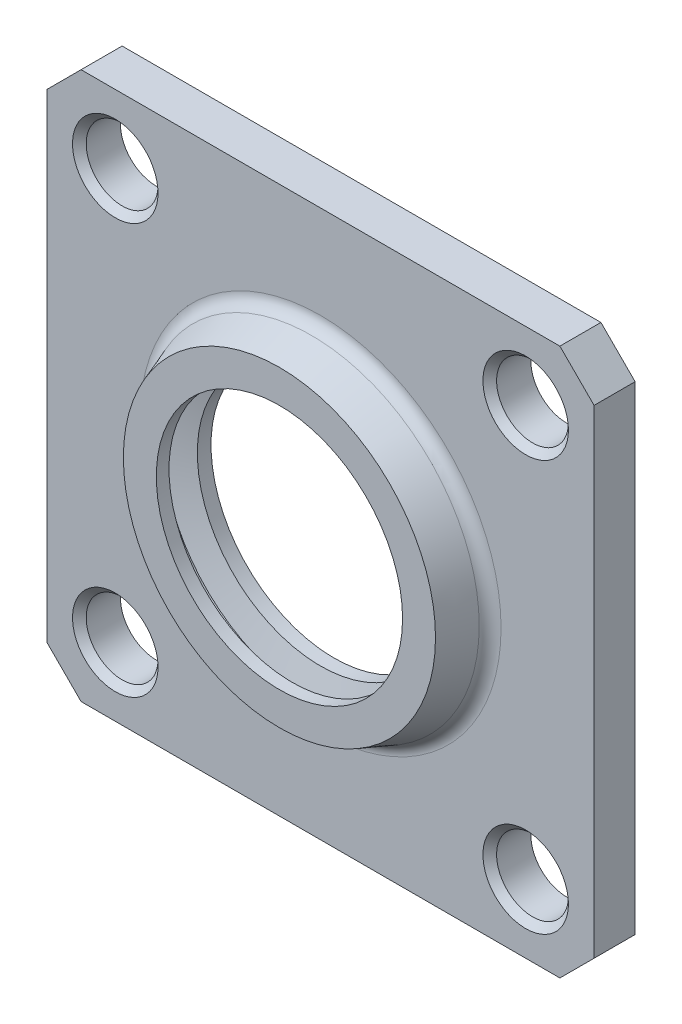
ISO-10303-21;
HEADER;
FILE_DESCRIPTION(('STEP AP214'),'2;1');
FILE_NAME('part.step','',(''),(''),'','','');
FILE_SCHEMA(('AUTOMOTIVE_DESIGN { 1 0 10303 214 1 1 1 1 }'));
ENDSEC;
DATA;
#1=APPLICATION_CONTEXT('core data for automotive mechanical design processes');
#2=APPLICATION_PROTOCOL_DEFINITION('international standard','automotive_design',2000,#1);
#3=PRODUCT_CONTEXT('',#1,'mechanical');
#4=PRODUCT('Part','Part','',(#3));
#5=PRODUCT_RELATED_PRODUCT_CATEGORY('part','',(#4));
#6=PRODUCT_DEFINITION_FORMATION('','',#4);
#7=PRODUCT_DEFINITION_CONTEXT('part definition',#1,'design');
#8=PRODUCT_DEFINITION('design','',#6,#7);
#9=PRODUCT_DEFINITION_SHAPE('','',#8);
#10=(LENGTH_UNIT() NAMED_UNIT(*) SI_UNIT(.MILLI.,.METRE.));
#11=(NAMED_UNIT(*) PLANE_ANGLE_UNIT() SI_UNIT($,.RADIAN.));
#12=(NAMED_UNIT(*) SI_UNIT($,.STERADIAN.) SOLID_ANGLE_UNIT());
#13=UNCERTAINTY_MEASURE_WITH_UNIT(LENGTH_MEASURE(1.E-05),#10,'distance_accuracy_value','');
#14=(GEOMETRIC_REPRESENTATION_CONTEXT(3) GLOBAL_UNCERTAINTY_ASSIGNED_CONTEXT((#13)) GLOBAL_UNIT_ASSIGNED_CONTEXT((#10,
#11,#12)) REPRESENTATION_CONTEXT('',''));
#15=CARTESIAN_POINT('',(0.,0.,0.));
#16=DIRECTION('',(0.,0.,1.));
#17=DIRECTION('',(1.,0.,0.));
#18=AXIS2_PLACEMENT_3D('',#15,#16,#17);
#19=CARTESIAN_POINT('',(-30.,-30.,0.959883800153095));
#20=DIRECTION('',(0.,-1.,0.));
#21=DIRECTION('',(0.,0.,-1.));
#22=AXIS2_PLACEMENT_3D('',#19,#20,#21);
#23=PLANE('',#22);
#24=DIRECTION('',(1.,0.,0.));
#25=VECTOR('',#24,1.);
#26=CARTESIAN_POINT('',(-30.,-30.,0.959883800153095));
#27=LINE('',#26,#25);
#28=CARTESIAN_POINT('',(-26.25,-30.,0.959883800153095));
#29=VERTEX_POINT('',#28);
#30=CARTESIAN_POINT('',(26.25,-30.,0.959883800153095));
#31=VERTEX_POINT('',#30);
#32=EDGE_CURVE('E301',#29,#31,#27,.T.);
#33=ORIENTED_EDGE('',*,*,#32,.T.);
#34=DIRECTION('',(0.,0.,1.));
#35=VECTOR('',#34,1.);
#36=CARTESIAN_POINT('',(26.25,-30.,0.959883800153095));
#37=LINE('',#36,#35);
#38=CARTESIAN_POINT('',(26.25,-30.,5.4598838001531));
#39=VERTEX_POINT('',#38);
#40=EDGE_CURVE('E121',#31,#39,#37,.T.);
#41=ORIENTED_EDGE('',*,*,#40,.T.);
#42=DIRECTION('',(1.,0.,0.));
#43=VECTOR('',#42,1.);
#44=CARTESIAN_POINT('',(-30.,-30.,5.4598838001531));
#45=LINE('',#44,#43);
#46=CARTESIAN_POINT('',(-26.25,-30.,5.4598838001531));
#47=VERTEX_POINT('',#46);
#48=EDGE_CURVE('E105',#47,#39,#45,.T.);
#49=ORIENTED_EDGE('',*,*,#48,.F.);
#50=DIRECTION('',(0.,0.,-1.));
#51=VECTOR('',#50,1.);
#52=CARTESIAN_POINT('',(-26.25,-30.,0.959883800153095));
#53=LINE('',#52,#51);
#54=EDGE_CURVE('E118',#47,#29,#53,.T.);
#55=ORIENTED_EDGE('',*,*,#54,.T.);
#56=EDGE_LOOP('',(#33,#41,#49,#55));
#57=FACE_BOUND('',#56,.T.);
#58=ADVANCED_FACE('F35',(#57),#23,.T.);
#59=CARTESIAN_POINT('',(-30.,30.,0.959883800153095));
#60=DIRECTION('',(-1.,0.,0.));
#61=DIRECTION('',(0.,0.,1.));
#62=AXIS2_PLACEMENT_3D('',#59,#60,#61);
#63=PLANE('',#62);
#64=DIRECTION('',(0.,-1.,0.));
#65=VECTOR('',#64,1.);
#66=CARTESIAN_POINT('',(-30.,30.,0.959883800153095));
#67=LINE('',#66,#65);
#68=CARTESIAN_POINT('',(-30.,26.25,0.959883800153095));
#69=VERTEX_POINT('',#68);
#70=CARTESIAN_POINT('',(-30.,-26.25,0.959883800153095));
#71=VERTEX_POINT('',#70);
#72=EDGE_CURVE('E128',#69,#71,#67,.T.);
#73=ORIENTED_EDGE('',*,*,#72,.T.);
#74=DIRECTION('',(0.,0.,1.));
#75=VECTOR('',#74,1.);
#76=CARTESIAN_POINT('',(-30.,-26.25,0.959883800153095));
#77=LINE('',#76,#75);
#78=CARTESIAN_POINT('',(-30.,-26.25,5.4598838001531));
#79=VERTEX_POINT('',#78);
#80=EDGE_CURVE('E154',#71,#79,#77,.T.);
#81=ORIENTED_EDGE('',*,*,#80,.T.);
#82=DIRECTION('',(0.,-1.,0.));
#83=VECTOR('',#82,1.);
#84=CARTESIAN_POINT('',(-30.,30.,5.4598838001531));
#85=LINE('',#84,#83);
#86=CARTESIAN_POINT('',(-30.,26.25,5.4598838001531));
#87=VERTEX_POINT('',#86);
#88=EDGE_CURVE('E107',#87,#79,#85,.T.);
#89=ORIENTED_EDGE('',*,*,#88,.F.);
#90=DIRECTION('',(0.,0.,-1.));
#91=VECTOR('',#90,1.);
#92=CARTESIAN_POINT('',(-30.,26.25,0.959883800153095));
#93=LINE('',#92,#91);
#94=EDGE_CURVE('E152',#87,#69,#93,.T.);
#95=ORIENTED_EDGE('',*,*,#94,.T.);
#96=EDGE_LOOP('',(#73,#81,#89,#95));
#97=FACE_BOUND('',#96,.T.);
#98=ADVANCED_FACE('F211',(#97),#63,.T.);
#99=CARTESIAN_POINT('',(30.,30.,0.959883800153095));
#100=DIRECTION('',(0.,1.,0.));
#101=DIRECTION('',(0.,0.,1.));
#102=AXIS2_PLACEMENT_3D('',#99,#100,#101);
#103=PLANE('',#102);
#104=DIRECTION('',(-1.,0.,0.));
#105=VECTOR('',#104,1.);
#106=CARTESIAN_POINT('',(30.,30.,5.4598838001531));
#107=LINE('',#106,#105);
#108=CARTESIAN_POINT('',(26.25,30.,5.4598838001531));
#109=VERTEX_POINT('',#108);
#110=CARTESIAN_POINT('',(-26.25,30.,5.4598838001531));
#111=VERTEX_POINT('',#110);
#112=EDGE_CURVE('E308',#109,#111,#107,.T.);
#113=ORIENTED_EDGE('',*,*,#112,.F.);
#114=DIRECTION('',(0.,0.,-1.));
#115=VECTOR('',#114,1.);
#116=CARTESIAN_POINT('',(26.25,30.,0.959883800153095));
#117=LINE('',#116,#115);
#118=CARTESIAN_POINT('',(26.25,30.,0.959883800153095));
#119=VERTEX_POINT('',#118);
#120=EDGE_CURVE('E57',#109,#119,#117,.T.);
#121=ORIENTED_EDGE('',*,*,#120,.T.);
#122=DIRECTION('',(-1.,0.,0.));
#123=VECTOR('',#122,1.);
#124=CARTESIAN_POINT('',(30.,30.,0.959883800153095));
#125=LINE('',#124,#123);
#126=CARTESIAN_POINT('',(-26.25,30.,0.959883800153095));
#127=VERTEX_POINT('',#126);
#128=EDGE_CURVE('E133',#119,#127,#125,.T.);
#129=ORIENTED_EDGE('',*,*,#128,.T.);
#130=DIRECTION('',(0.,0.,1.));
#131=VECTOR('',#130,1.);
#132=CARTESIAN_POINT('',(-26.25,30.,0.959883800153095));
#133=LINE('',#132,#131);
#134=EDGE_CURVE('E156',#127,#111,#133,.T.);
#135=ORIENTED_EDGE('',*,*,#134,.T.);
#136=EDGE_LOOP('',(#113,#121,#129,#135));
#137=FACE_BOUND('',#136,.T.);
#138=ADVANCED_FACE('F216',(#137),#103,.T.);
#139=CARTESIAN_POINT('',(30.,-30.,0.959883800153095));
#140=DIRECTION('',(1.,0.,0.));
#141=DIRECTION('',(0.,0.,-1.));
#142=AXIS2_PLACEMENT_3D('',#139,#140,#141);
#143=PLANE('',#142);
#144=DIRECTION('',(0.,1.,0.));
#145=VECTOR('',#144,1.);
#146=CARTESIAN_POINT('',(30.,-30.,5.4598838001531));
#147=LINE('',#146,#145);
#148=CARTESIAN_POINT('',(30.,-26.25,5.4598838001531));
#149=VERTEX_POINT('',#148);
#150=CARTESIAN_POINT('',(30.,26.25,5.4598838001531));
#151=VERTEX_POINT('',#150);
#152=EDGE_CURVE('E122',#149,#151,#147,.T.);
#153=ORIENTED_EDGE('',*,*,#152,.F.);
#154=DIRECTION('',(0.,0.,-1.));
#155=VECTOR('',#154,1.);
#156=CARTESIAN_POINT('',(30.,-26.25,0.959883800153095));
#157=LINE('',#156,#155);
#158=CARTESIAN_POINT('',(30.,-26.25,0.959883800153095));
#159=VERTEX_POINT('',#158);
#160=EDGE_CURVE('E144',#149,#159,#157,.T.);
#161=ORIENTED_EDGE('',*,*,#160,.T.);
#162=DIRECTION('',(0.,1.,0.));
#163=VECTOR('',#162,1.);
#164=CARTESIAN_POINT('',(30.,-30.,0.959883800153095));
#165=LINE('',#164,#163);
#166=CARTESIAN_POINT('',(30.,26.25,0.959883800153095));
#167=VERTEX_POINT('',#166);
#168=EDGE_CURVE('E303',#159,#167,#165,.T.);
#169=ORIENTED_EDGE('',*,*,#168,.T.);
#170=DIRECTION('',(0.,0.,1.));
#171=VECTOR('',#170,1.);
#172=CARTESIAN_POINT('',(30.,26.25,0.959883800153095));
#173=LINE('',#172,#171);
#174=EDGE_CURVE('E141',#167,#151,#173,.T.);
#175=ORIENTED_EDGE('',*,*,#174,.T.);
#176=EDGE_LOOP('',(#153,#161,#169,#175));
#177=FACE_BOUND('',#176,.T.);
#178=ADVANCED_FACE('F221',(#177),#143,.T.);
#179=CARTESIAN_POINT('',(0.,0.,0.959883800153095));
#180=DIRECTION('',(0.,0.,1.));
#181=DIRECTION('',(1.,0.,0.));
#182=AXIS2_PLACEMENT_3D('',#179,#180,#181);
#183=PLANE('',#182);
#184=CARTESIAN_POINT('',(0.,0.,0.959883800153095));
#185=DIRECTION('',(0.,0.,1.));
#186=DIRECTION('',(1.,0.,0.));
#187=AXIS2_PLACEMENT_3D('',#184,#185,#186);
#188=CIRCLE('',#187,20.2500000000295);
#189=CARTESIAN_POINT('',(20.2500000000295,0.,0.959883800153095));
#190=VERTEX_POINT('',#189);
#191=EDGE_CURVE('E178',#190,#190,#188,.T.);
#192=ORIENTED_EDGE('',*,*,#191,.T.);
#193=EDGE_LOOP('',(#192));
#194=FACE_BOUND('',#193,.T.);
#195=CARTESIAN_POINT('',(22.5,22.5,0.959883800153092));
#196=DIRECTION('',(0.,0.,1.));
#197=DIRECTION('',(1.,0.,0.));
#198=AXIS2_PLACEMENT_3D('',#195,#196,#197);
#199=CIRCLE('',#198,3.93749999999999);
#200=CARTESIAN_POINT('',(26.4375,22.5,0.959883800153092));
#201=VERTEX_POINT('',#200);
#202=EDGE_CURVE('E268',#201,#201,#199,.T.);
#203=ORIENTED_EDGE('',*,*,#202,.T.);
#204=EDGE_LOOP('',(#203));
#205=FACE_BOUND('',#204,.T.);
#206=CARTESIAN_POINT('',(-22.5,22.5,0.959883800153092));
#207=DIRECTION('',(0.,0.,1.));
#208=DIRECTION('',(1.,0.,0.));
#209=AXIS2_PLACEMENT_3D('',#206,#207,#208);
#210=CIRCLE('',#209,3.93749999999999);
#211=CARTESIAN_POINT('',(-18.5625,22.5,0.959883800153092));
#212=VERTEX_POINT('',#211);
#213=EDGE_CURVE('E270',#212,#212,#210,.T.);
#214=ORIENTED_EDGE('',*,*,#213,.T.);
#215=EDGE_LOOP('',(#214));
#216=FACE_BOUND('',#215,.T.);
#217=CARTESIAN_POINT('',(-22.5,-22.5,0.959883800153092));
#218=DIRECTION('',(0.,0.,1.));
#219=DIRECTION('',(1.,0.,0.));
#220=AXIS2_PLACEMENT_3D('',#217,#218,#219);
#221=CIRCLE('',#220,3.93749999999999);
#222=CARTESIAN_POINT('',(-18.5625,-22.5,0.959883800153092));
#223=VERTEX_POINT('',#222);
#224=EDGE_CURVE('E273',#223,#223,#221,.T.);
#225=ORIENTED_EDGE('',*,*,#224,.T.);
#226=EDGE_LOOP('',(#225));
#227=FACE_BOUND('',#226,.T.);
#228=CARTESIAN_POINT('',(22.5,-22.5,0.959883800153092));
#229=DIRECTION('',(0.,0.,1.));
#230=DIRECTION('',(1.,0.,0.));
#231=AXIS2_PLACEMENT_3D('',#228,#229,#230);
#232=CIRCLE('',#231,3.93749999999999);
#233=CARTESIAN_POINT('',(26.4375,-22.5,0.959883800153092));
#234=VERTEX_POINT('',#233);
#235=EDGE_CURVE('E278',#234,#234,#232,.T.);
#236=ORIENTED_EDGE('',*,*,#235,.T.);
#237=EDGE_LOOP('',(#236));
#238=FACE_BOUND('',#237,.T.);
#239=ORIENTED_EDGE('',*,*,#168,.F.);
#240=DIRECTION('',(0.707106781186546,0.707106781186549,0.));
#241=VECTOR('',#240,1.);
#242=CARTESIAN_POINT('',(26.25,-30.,0.959883800153095));
#243=LINE('',#242,#241);
#244=EDGE_CURVE('E150',#159,#31,#243,.F.);
#245=ORIENTED_EDGE('',*,*,#244,.T.);
#246=ORIENTED_EDGE('',*,*,#32,.F.);
#247=DIRECTION('',(0.707106781186549,-0.707106781186546,0.));
#248=VECTOR('',#247,1.);
#249=CARTESIAN_POINT('',(-30.,-26.25,0.959883800153095));
#250=LINE('',#249,#248);
#251=EDGE_CURVE('E127',#29,#71,#250,.F.);
#252=ORIENTED_EDGE('',*,*,#251,.T.);
#253=ORIENTED_EDGE('',*,*,#72,.F.);
#254=DIRECTION('',(-0.707106781186546,-0.707106781186549,0.));
#255=VECTOR('',#254,1.);
#256=CARTESIAN_POINT('',(-26.25,30.,0.959883800153095));
#257=LINE('',#256,#255);
#258=EDGE_CURVE('E50',#69,#127,#257,.F.);
#259=ORIENTED_EDGE('',*,*,#258,.T.);
#260=ORIENTED_EDGE('',*,*,#128,.F.);
#261=DIRECTION('',(-0.707106781186549,0.707106781186546,0.));
#262=VECTOR('',#261,1.);
#263=CARTESIAN_POINT('',(30.,26.25,0.959883800153095));
#264=LINE('',#263,#262);
#265=EDGE_CURVE('E147',#119,#167,#264,.F.);
#266=ORIENTED_EDGE('',*,*,#265,.T.);
#267=EDGE_LOOP('',(#239,#245,#246,#252,#253,#259,#260,#266));
#268=FACE_BOUND('',#267,.T.);
#269=ADVANCED_FACE('F314',(#194,#205,#216,#227,#238,#268),#183,.F.);
#270=CARTESIAN_POINT('',(0.,0.,5.4598838001531));
#271=DIRECTION('',(0.,0.,1.));
#272=DIRECTION('',(1.,0.,0.));
#273=AXIS2_PLACEMENT_3D('',#270,#271,#272);
#274=PLANE('',#273);
#275=CARTESIAN_POINT('',(0.,0.,5.4598838001531));
#276=DIRECTION('',(0.,0.,1.));
#277=DIRECTION('',(1.,0.,0.));
#278=AXIS2_PLACEMENT_3D('',#275,#276,#277);
#279=CIRCLE('',#278,19.8003113073173);
#280=CARTESIAN_POINT('',(19.8003113073173,0.,5.4598838001531));
#281=VERTEX_POINT('',#280);
#282=EDGE_CURVE('E11',#281,#281,#279,.F.);
#283=ORIENTED_EDGE('',*,*,#282,.T.);
#284=EDGE_LOOP('',(#283));
#285=FACE_BOUND('',#284,.T.);
#286=CARTESIAN_POINT('',(-22.5,-22.5,5.4598838001531));
#287=DIRECTION('',(0.,0.,1.));
#288=DIRECTION('',(1.,0.,0.));
#289=AXIS2_PLACEMENT_3D('',#286,#287,#288);
#290=CIRCLE('',#289,4.6875000000295);
#291=CARTESIAN_POINT('',(-17.8124999999705,-22.5,5.4598838001531));
#292=VERTEX_POINT('',#291);
#293=EDGE_CURVE('E172',#292,#292,#290,.F.);
#294=ORIENTED_EDGE('',*,*,#293,.T.);
#295=EDGE_LOOP('',(#294));
#296=FACE_BOUND('',#295,.T.);
#297=CARTESIAN_POINT('',(22.5,-22.5,5.4598838001531));
#298=DIRECTION('',(0.,0.,1.));
#299=DIRECTION('',(1.,0.,0.));
#300=AXIS2_PLACEMENT_3D('',#297,#298,#299);
#301=CIRCLE('',#300,4.6875000000295);
#302=CARTESIAN_POINT('',(27.1875000000295,-22.5,5.4598838001531));
#303=VERTEX_POINT('',#302);
#304=EDGE_CURVE('E169',#303,#303,#301,.F.);
#305=ORIENTED_EDGE('',*,*,#304,.T.);
#306=EDGE_LOOP('',(#305));
#307=FACE_BOUND('',#306,.T.);
#308=CARTESIAN_POINT('',(-22.5,22.5,5.4598838001531));
#309=DIRECTION('',(0.,0.,1.));
#310=DIRECTION('',(1.,0.,0.));
#311=AXIS2_PLACEMENT_3D('',#308,#309,#310);
#312=CIRCLE('',#311,4.6875000000295);
#313=CARTESIAN_POINT('',(-17.8124999999705,22.5,5.4598838001531));
#314=VERTEX_POINT('',#313);
#315=EDGE_CURVE('E166',#314,#314,#312,.F.);
#316=ORIENTED_EDGE('',*,*,#315,.T.);
#317=EDGE_LOOP('',(#316));
#318=FACE_BOUND('',#317,.T.);
#319=CARTESIAN_POINT('',(22.5,22.5,5.4598838001531));
#320=DIRECTION('',(0.,0.,1.));
#321=DIRECTION('',(1.,0.,0.));
#322=AXIS2_PLACEMENT_3D('',#319,#320,#321);
#323=CIRCLE('',#322,4.6875000000295);
#324=CARTESIAN_POINT('',(27.1875000000295,22.5,5.4598838001531));
#325=VERTEX_POINT('',#324);
#326=EDGE_CURVE('E163',#325,#325,#323,.F.);
#327=ORIENTED_EDGE('',*,*,#326,.T.);
#328=EDGE_LOOP('',(#327));
#329=FACE_BOUND('',#328,.T.);
#330=ORIENTED_EDGE('',*,*,#48,.T.);
#331=DIRECTION('',(-0.707106781186546,-0.707106781186549,0.));
#332=VECTOR('',#331,1.);
#333=CARTESIAN_POINT('',(28.1250000000001,-28.1249999999999,5.4598838001531));
#334=LINE('',#333,#332);
#335=EDGE_CURVE('E112',#39,#149,#334,.F.);
#336=ORIENTED_EDGE('',*,*,#335,.T.);
#337=ORIENTED_EDGE('',*,*,#152,.T.);
#338=DIRECTION('',(0.707106781186549,-0.707106781186546,0.));
#339=VECTOR('',#338,1.);
#340=CARTESIAN_POINT('',(28.1249999999999,28.1250000000001,5.4598838001531));
#341=LINE('',#340,#339);
#342=EDGE_CURVE('E113',#151,#109,#341,.F.);
#343=ORIENTED_EDGE('',*,*,#342,.T.);
#344=ORIENTED_EDGE('',*,*,#112,.T.);
#345=DIRECTION('',(0.707106781186546,0.707106781186549,0.));
#346=VECTOR('',#345,1.);
#347=CARTESIAN_POINT('',(-28.1250000000001,28.1249999999999,5.4598838001531));
#348=LINE('',#347,#346);
#349=EDGE_CURVE('E130',#111,#87,#348,.F.);
#350=ORIENTED_EDGE('',*,*,#349,.T.);
#351=ORIENTED_EDGE('',*,*,#88,.T.);
#352=DIRECTION('',(-0.707106781186549,0.707106781186546,0.));
#353=VECTOR('',#352,1.);
#354=CARTESIAN_POINT('',(-28.1249999999999,-28.1250000000001,5.4598838001531));
#355=LINE('',#354,#353);
#356=EDGE_CURVE('E102',#79,#47,#355,.F.);
#357=ORIENTED_EDGE('',*,*,#356,.T.);
#358=EDGE_LOOP('',(#330,#336,#337,#343,#344,#350,#351,#357));
#359=FACE_BOUND('',#358,.T.);
#360=ADVANCED_FACE('F104',(#285,#296,#307,#318,#329,#359),#274,.T.);
#361=CARTESIAN_POINT('',(0.,0.,9.9598838001531));
#362=DIRECTION('',(0.,0.,-1.));
#363=DIRECTION('',(-1.,0.,0.));
#364=AXIS2_PLACEMENT_3D('',#361,#362,#363);
#365=CONICAL_SURFACE('',#364,17.1121339458051,0.3490658503988);
#366=CARTESIAN_POINT('',(0.,0.,6.44685358516469));
#367=DIRECTION('',(0.,0.,-1.));
#368=DIRECTION('',(-1.,0.,0.));
#369=AXIS2_PLACEMENT_3D('',#366,#367,#368);
#370=CIRCLE('',#369,18.3907723761384);
#371=CARTESIAN_POINT('',(-18.3907723761384,0.,6.44685358516469));
#372=VERTEX_POINT('',#371);
#373=EDGE_CURVE('E43',#372,#372,#370,.F.);
#374=ORIENTED_EDGE('',*,*,#373,.T.);
#375=EDGE_LOOP('',(#374));
#376=FACE_BOUND('',#375,.T.);
#377=CARTESIAN_POINT('',(0.,0.,9.9598838001531));
#378=DIRECTION('',(0.,0.,1.));
#379=DIRECTION('',(1.,0.,0.));
#380=AXIS2_PLACEMENT_3D('',#377,#378,#379);
#381=CIRCLE('',#380,17.1121339458051);
#382=CARTESIAN_POINT('',(17.1121339458051,0.,9.9598838001531));
#383=VERTEX_POINT('',#382);
#384=EDGE_CURVE('E123',#383,#383,#381,.T.);
#385=ORIENTED_EDGE('',*,*,#384,.F.);
#386=EDGE_LOOP('',(#385));
#387=FACE_BOUND('',#386,.T.);
#388=ADVANCED_FACE('F198',(#376,#387),#365,.T.);
#389=CARTESIAN_POINT('',(0.,0.,9.9598838001531));
#390=DIRECTION('',(0.,0.,1.));
#391=DIRECTION('',(1.,0.,0.));
#392=AXIS2_PLACEMENT_3D('',#389,#390,#391);
#393=PLANE('',#392);
#394=CARTESIAN_POINT('',(0.,0.,9.9598838001531));
#395=DIRECTION('',(0.,0.,1.));
#396=DIRECTION('',(1.,0.,0.));
#397=AXIS2_PLACEMENT_3D('',#394,#395,#396);
#398=CIRCLE('',#397,13.5);
#399=CARTESIAN_POINT('',(13.5,0.,9.9598838001531));
#400=VERTEX_POINT('',#399);
#401=EDGE_CURVE('E296',#400,#400,#398,.T.);
#402=ORIENTED_EDGE('',*,*,#401,.F.);
#403=EDGE_LOOP('',(#402));
#404=FACE_BOUND('',#403,.T.);
#405=ORIENTED_EDGE('',*,*,#384,.T.);
#406=EDGE_LOOP('',(#405));
#407=FACE_BOUND('',#406,.T.);
#408=ADVANCED_FACE('F335',(#404,#407),#393,.T.);
#409=CARTESIAN_POINT('',(0.,0.,0.959883800153095));
#410=DIRECTION('',(0.,0.,1.));
#411=DIRECTION('',(1.,0.,0.));
#412=AXIS2_PLACEMENT_3D('',#409,#410,#411);
#413=CYLINDRICAL_SURFACE('',#412,19.5);
#414=CARTESIAN_POINT('',(0.,0.,3.20988380015309));
#415=DIRECTION('',(0.,0.,1.));
#416=DIRECTION('',(1.,0.,0.));
#417=AXIS2_PLACEMENT_3D('',#414,#415,#416);
#418=CIRCLE('',#417,19.5);
#419=CARTESIAN_POINT('',(19.5,0.,3.20988380015309));
#420=VERTEX_POINT('',#419);
#421=EDGE_CURVE('E190',#420,#420,#418,.T.);
#422=ORIENTED_EDGE('',*,*,#421,.T.);
#423=EDGE_LOOP('',(#422));
#424=FACE_BOUND('',#423,.T.);
#425=CARTESIAN_POINT('',(0.,0.,1.70988380018259));
#426=DIRECTION('',(0.,0.,1.));
#427=DIRECTION('',(1.,0.,0.));
#428=AXIS2_PLACEMENT_3D('',#425,#426,#427);
#429=CIRCLE('',#428,19.5);
#430=CARTESIAN_POINT('',(19.5,0.,1.70988380018259));
#431=VERTEX_POINT('',#430);
#432=EDGE_CURVE('E181',#431,#431,#429,.F.);
#433=ORIENTED_EDGE('',*,*,#432,.T.);
#434=EDGE_LOOP('',(#433));
#435=FACE_BOUND('',#434,.T.);
#436=ADVANCED_FACE('F338',(#424,#435),#413,.F.);
#437=CARTESIAN_POINT('',(0.,0.,0.959883800153095));
#438=DIRECTION('',(0.,0.,1.));
#439=DIRECTION('',(1.,0.,0.));
#440=AXIS2_PLACEMENT_3D('',#437,#438,#439);
#441=CYLINDRICAL_SURFACE('',#440,13.5);
#442=CARTESIAN_POINT('',(0.,0.,8.56757895474059));
#443=DIRECTION('',(0.,0.,1.));
#444=DIRECTION('',(1.,0.,0.));
#445=AXIS2_PLACEMENT_3D('',#442,#443,#444);
#446=CIRCLE('',#445,13.5);
#447=CARTESIAN_POINT('',(13.5,0.,8.56757895474059));
#448=VERTEX_POINT('',#447);
#449=EDGE_CURVE('E293',#448,#448,#446,.T.);
#450=ORIENTED_EDGE('',*,*,#449,.F.);
#451=EDGE_LOOP('',(#450));
#452=FACE_BOUND('',#451,.T.);
#453=ORIENTED_EDGE('',*,*,#401,.T.);
#454=EDGE_LOOP('',(#453));
#455=FACE_BOUND('',#454,.T.);
#456=ADVANCED_FACE('F342',(#452,#455),#441,.F.);
#457=CARTESIAN_POINT('',(0.,0.,8.56757895474059));
#458=DIRECTION('',(0.,0.,-1.));
#459=DIRECTION('',(-1.,0.,0.));
#460=AXIS2_PLACEMENT_3D('',#457,#458,#459);
#461=CONICAL_SURFACE('',#460,13.5,1.30899693899545);
#462=CARTESIAN_POINT('',(0.,0.,7.76373137744627));
#463=DIRECTION('',(0.,0.,1.));
#464=DIRECTION('',(1.,0.,0.));
#465=AXIS2_PLACEMENT_3D('',#462,#463,#464);
#466=CIRCLE('',#465,16.5);
#467=CARTESIAN_POINT('',(16.5,0.,7.76373137744627));
#468=VERTEX_POINT('',#467);
#469=EDGE_CURVE('E290',#468,#468,#466,.T.);
#470=ORIENTED_EDGE('',*,*,#469,.F.);
#471=EDGE_LOOP('',(#470));
#472=FACE_BOUND('',#471,.T.);
#473=ORIENTED_EDGE('',*,*,#449,.T.);
#474=EDGE_LOOP('',(#473));
#475=FACE_BOUND('',#474,.T.);
#476=ADVANCED_FACE('F346',(#472,#475),#461,.F.);
#477=CARTESIAN_POINT('',(0.,0.,0.959883800153095));
#478=DIRECTION('',(0.,0.,1.));
#479=DIRECTION('',(1.,0.,0.));
#480=AXIS2_PLACEMENT_3D('',#477,#478,#479);
#481=CYLINDRICAL_SURFACE('',#480,16.5);
#482=CARTESIAN_POINT('',(0.,0.,6.26373137744664));
#483=DIRECTION('',(0.,0.,1.));
#484=DIRECTION('',(1.,0.,0.));
#485=AXIS2_PLACEMENT_3D('',#482,#483,#484);
#486=CIRCLE('',#485,16.5);
#487=CARTESIAN_POINT('',(16.5,0.,6.26373137744664));
#488=VERTEX_POINT('',#487);
#489=EDGE_CURVE('E287',#488,#488,#486,.T.);
#490=ORIENTED_EDGE('',*,*,#489,.F.);
#491=EDGE_LOOP('',(#490));
#492=FACE_BOUND('',#491,.T.);
#493=ORIENTED_EDGE('',*,*,#469,.T.);
#494=EDGE_LOOP('',(#493));
#495=FACE_BOUND('',#494,.T.);
#496=ADVANCED_FACE('F350',(#492,#495),#481,.F.);
#497=CARTESIAN_POINT('',(0.,0.,6.26373137744664));
#498=DIRECTION('',(0.,0.,1.));
#499=DIRECTION('',(1.,0.,0.));
#500=AXIS2_PLACEMENT_3D('',#497,#498,#499);
#501=CONICAL_SURFACE('',#500,16.5,1.30899693899569);
#502=CARTESIAN_POINT('',(0.,0.,5.4598838001531));
#503=DIRECTION('',(0.,0.,1.));
#504=DIRECTION('',(1.,0.,0.));
#505=AXIS2_PLACEMENT_3D('',#502,#503,#504);
#506=CIRCLE('',#505,13.5);
#507=CARTESIAN_POINT('',(13.5,0.,5.4598838001531));
#508=VERTEX_POINT('',#507);
#509=EDGE_CURVE('E284',#508,#508,#506,.T.);
#510=ORIENTED_EDGE('',*,*,#509,.F.);
#511=EDGE_LOOP('',(#510));
#512=FACE_BOUND('',#511,.T.);
#513=ORIENTED_EDGE('',*,*,#489,.T.);
#514=EDGE_LOOP('',(#513));
#515=FACE_BOUND('',#514,.T.);
#516=ADVANCED_FACE('F354',(#512,#515),#501,.F.);
#517=CARTESIAN_POINT('',(0.,0.,0.959883800153095));
#518=DIRECTION('',(0.,0.,1.));
#519=DIRECTION('',(1.,0.,0.));
#520=AXIS2_PLACEMENT_3D('',#517,#518,#519);
#521=CYLINDRICAL_SURFACE('',#520,13.5);
#522=CARTESIAN_POINT('',(0.,0.,3.9598838001531));
#523=DIRECTION('',(0.,0.,1.));
#524=DIRECTION('',(1.,0.,0.));
#525=AXIS2_PLACEMENT_3D('',#522,#523,#524);
#526=CIRCLE('',#525,13.5);
#527=CARTESIAN_POINT('',(13.5,0.,3.9598838001531));
#528=VERTEX_POINT('',#527);
#529=EDGE_CURVE('E281',#528,#528,#526,.T.);
#530=ORIENTED_EDGE('',*,*,#529,.F.);
#531=EDGE_LOOP('',(#530));
#532=FACE_BOUND('',#531,.T.);
#533=ORIENTED_EDGE('',*,*,#509,.T.);
#534=EDGE_LOOP('',(#533));
#535=FACE_BOUND('',#534,.T.);
#536=ADVANCED_FACE('F358',(#532,#535),#521,.F.);
#537=CARTESIAN_POINT('',(13.5,0.,3.9598838001531));
#538=DIRECTION('',(0.,0.,1.));
#539=DIRECTION('',(1.,0.,0.));
#540=AXIS2_PLACEMENT_3D('',#537,#538,#539);
#541=PLANE('',#540);
#542=CARTESIAN_POINT('',(0.,0.,3.9598838001531));
#543=DIRECTION('',(0.,0.,1.));
#544=DIRECTION('',(1.,0.,0.));
#545=AXIS2_PLACEMENT_3D('',#542,#543,#544);
#546=CIRCLE('',#545,18.75);
#547=CARTESIAN_POINT('',(18.75,0.,3.9598838001531));
#548=VERTEX_POINT('',#547);
#549=EDGE_CURVE('E193',#548,#548,#546,.F.);
#550=ORIENTED_EDGE('',*,*,#549,.T.);
#551=EDGE_LOOP('',(#550));
#552=FACE_BOUND('',#551,.T.);
#553=ORIENTED_EDGE('',*,*,#529,.T.);
#554=EDGE_LOOP('',(#553));
#555=FACE_BOUND('',#554,.T.);
#556=ADVANCED_FACE('F362',(#552,#555),#541,.F.);
#557=CARTESIAN_POINT('',(22.5,-22.5,5.4598838001531));
#558=DIRECTION('',(0.,0.,1.));
#559=DIRECTION('',(1.,0.,0.));
#560=AXIS2_PLACEMENT_3D('',#557,#558,#559);
#561=CYLINDRICAL_SURFACE('',#560,3.93749999999999);
#562=CARTESIAN_POINT('',(22.5,-22.5,4.70988380012359));
#563=DIRECTION('',(0.,0.,1.));
#564=DIRECTION('',(1.,0.,0.));
#565=AXIS2_PLACEMENT_3D('',#562,#563,#564);
#566=CIRCLE('',#565,3.93749999999999);
#567=CARTESIAN_POINT('',(26.4375,-22.5,4.70988380012359));
#568=VERTEX_POINT('',#567);
#569=EDGE_CURVE('E175',#568,#568,#566,.T.);
#570=ORIENTED_EDGE('',*,*,#569,.T.);
#571=EDGE_LOOP('',(#570));
#572=FACE_BOUND('',#571,.T.);
#573=ORIENTED_EDGE('',*,*,#235,.F.);
#574=EDGE_LOOP('',(#573));
#575=FACE_BOUND('',#574,.T.);
#576=ADVANCED_FACE('F366',(#572,#575),#561,.F.);
#577=CARTESIAN_POINT('',(-22.5,-22.5,5.4598838001531));
#578=DIRECTION('',(0.,0.,1.));
#579=DIRECTION('',(1.,0.,0.));
#580=AXIS2_PLACEMENT_3D('',#577,#578,#579);
#581=CYLINDRICAL_SURFACE('',#580,3.93749999999999);
#582=CARTESIAN_POINT('',(-22.5,-22.5,4.70988380012359));
#583=DIRECTION('',(0.,0.,1.));
#584=DIRECTION('',(1.,0.,0.));
#585=AXIS2_PLACEMENT_3D('',#582,#583,#584);
#586=CIRCLE('',#585,3.93749999999999);
#587=CARTESIAN_POINT('',(-18.5625,-22.5,4.70988380012359));
#588=VERTEX_POINT('',#587);
#589=EDGE_CURVE('E160',#588,#588,#586,.T.);
#590=ORIENTED_EDGE('',*,*,#589,.T.);
#591=EDGE_LOOP('',(#590));
#592=FACE_BOUND('',#591,.T.);
#593=ORIENTED_EDGE('',*,*,#224,.F.);
#594=EDGE_LOOP('',(#593));
#595=FACE_BOUND('',#594,.T.);
#596=ADVANCED_FACE('F370',(#592,#595),#581,.F.);
#597=CARTESIAN_POINT('',(-22.5,22.5,5.4598838001531));
#598=DIRECTION('',(0.,0.,1.));
#599=DIRECTION('',(1.,0.,0.));
#600=AXIS2_PLACEMENT_3D('',#597,#598,#599);
#601=CYLINDRICAL_SURFACE('',#600,3.93749999999999);
#602=CARTESIAN_POINT('',(-22.5,22.5,4.70988380012359));
#603=DIRECTION('',(0.,0.,1.));
#604=DIRECTION('',(1.,0.,0.));
#605=AXIS2_PLACEMENT_3D('',#602,#603,#604);
#606=CIRCLE('',#605,3.93749999999999);
#607=CARTESIAN_POINT('',(-18.5625,22.5,4.70988380012359));
#608=VERTEX_POINT('',#607);
#609=EDGE_CURVE('E184',#608,#608,#606,.T.);
#610=ORIENTED_EDGE('',*,*,#609,.T.);
#611=EDGE_LOOP('',(#610));
#612=FACE_BOUND('',#611,.T.);
#613=ORIENTED_EDGE('',*,*,#213,.F.);
#614=EDGE_LOOP('',(#613));
#615=FACE_BOUND('',#614,.T.);
#616=ADVANCED_FACE('F264',(#612,#615),#601,.F.);
#617=CARTESIAN_POINT('',(22.5,22.5,5.4598838001531));
#618=DIRECTION('',(0.,0.,1.));
#619=DIRECTION('',(1.,0.,0.));
#620=AXIS2_PLACEMENT_3D('',#617,#618,#619);
#621=CYLINDRICAL_SURFACE('',#620,3.93749999999999);
#622=CARTESIAN_POINT('',(22.5,22.5,4.70988380012359));
#623=DIRECTION('',(0.,0.,1.));
#624=DIRECTION('',(1.,0.,0.));
#625=AXIS2_PLACEMENT_3D('',#622,#623,#624);
#626=CIRCLE('',#625,3.93749999999999);
#627=CARTESIAN_POINT('',(26.4375,22.5,4.70988380012359));
#628=VERTEX_POINT('',#627);
#629=EDGE_CURVE('E187',#628,#628,#626,.T.);
#630=ORIENTED_EDGE('',*,*,#629,.T.);
#631=EDGE_LOOP('',(#630));
#632=FACE_BOUND('',#631,.T.);
#633=ORIENTED_EDGE('',*,*,#202,.F.);
#634=EDGE_LOOP('',(#633));
#635=FACE_BOUND('',#634,.T.);
#636=ADVANCED_FACE('F226',(#632,#635),#621,.F.);
#637=CARTESIAN_POINT('',(26.25,-30.,0.959883800153095));
#638=DIRECTION('',(-0.707106781186549,0.707106781186545,0.));
#639=DIRECTION('',(0.,0.,1.));
#640=AXIS2_PLACEMENT_3D('',#637,#638,#639);
#641=PLANE('',#640);
#642=ORIENTED_EDGE('',*,*,#244,.F.);
#643=ORIENTED_EDGE('',*,*,#160,.F.);
#644=ORIENTED_EDGE('',*,*,#335,.F.);
#645=ORIENTED_EDGE('',*,*,#40,.F.);
#646=EDGE_LOOP('',(#642,#643,#644,#645));
#647=FACE_BOUND('',#646,.T.);
#648=ADVANCED_FACE('F223',(#647),#641,.F.);
#649=CARTESIAN_POINT('',(-30.,-26.25,0.959883800153095));
#650=DIRECTION('',(0.707106781186545,0.707106781186549,0.));
#651=DIRECTION('',(0.,0.,1.));
#652=AXIS2_PLACEMENT_3D('',#649,#650,#651);
#653=PLANE('',#652);
#654=ORIENTED_EDGE('',*,*,#251,.F.);
#655=ORIENTED_EDGE('',*,*,#54,.F.);
#656=ORIENTED_EDGE('',*,*,#356,.F.);
#657=ORIENTED_EDGE('',*,*,#80,.F.);
#658=EDGE_LOOP('',(#654,#655,#656,#657));
#659=FACE_BOUND('',#658,.T.);
#660=ADVANCED_FACE('F126',(#659),#653,.F.);
#661=CARTESIAN_POINT('',(30.,26.25,0.959883800153095));
#662=DIRECTION('',(-0.707106781186545,-0.707106781186549,0.));
#663=DIRECTION('',(0.,0.,1.));
#664=AXIS2_PLACEMENT_3D('',#661,#662,#663);
#665=PLANE('',#664);
#666=ORIENTED_EDGE('',*,*,#265,.F.);
#667=ORIENTED_EDGE('',*,*,#120,.F.);
#668=ORIENTED_EDGE('',*,*,#342,.F.);
#669=ORIENTED_EDGE('',*,*,#174,.F.);
#670=EDGE_LOOP('',(#666,#667,#668,#669));
#671=FACE_BOUND('',#670,.T.);
#672=ADVANCED_FACE('F230',(#671),#665,.F.);
#673=CARTESIAN_POINT('',(-26.25,30.,0.959883800153095));
#674=DIRECTION('',(0.707106781186549,-0.707106781186545,0.));
#675=DIRECTION('',(0.,0.,1.));
#676=AXIS2_PLACEMENT_3D('',#673,#674,#675);
#677=PLANE('',#676);
#678=ORIENTED_EDGE('',*,*,#258,.F.);
#679=ORIENTED_EDGE('',*,*,#94,.F.);
#680=ORIENTED_EDGE('',*,*,#349,.F.);
#681=ORIENTED_EDGE('',*,*,#134,.F.);
#682=EDGE_LOOP('',(#678,#679,#680,#681));
#683=FACE_BOUND('',#682,.T.);
#684=ADVANCED_FACE('F233',(#683),#677,.F.);
#685=CARTESIAN_POINT('',(-22.5,-22.5,4.70988380012359));
#686=DIRECTION('',(0.,0.,1.));
#687=DIRECTION('',(1.,0.,0.));
#688=AXIS2_PLACEMENT_3D('',#685,#686,#687);
#689=CONICAL_SURFACE('',#688,3.93749999999999,0.785398163397451);
#690=ORIENTED_EDGE('',*,*,#293,.F.);
#691=EDGE_LOOP('',(#690));
#692=FACE_BOUND('',#691,.T.);
#693=ORIENTED_EDGE('',*,*,#589,.F.);
#694=EDGE_LOOP('',(#693));
#695=FACE_BOUND('',#694,.T.);
#696=ADVANCED_FACE('F237',(#692,#695),#689,.F.);
#697=CARTESIAN_POINT('',(22.5,-22.5,4.70988380012359));
#698=DIRECTION('',(0.,0.,1.));
#699=DIRECTION('',(1.,0.,0.));
#700=AXIS2_PLACEMENT_3D('',#697,#698,#699);
#701=CONICAL_SURFACE('',#700,3.93749999999999,0.785398163397451);
#702=ORIENTED_EDGE('',*,*,#304,.F.);
#703=EDGE_LOOP('',(#702));
#704=FACE_BOUND('',#703,.T.);
#705=ORIENTED_EDGE('',*,*,#569,.F.);
#706=EDGE_LOOP('',(#705));
#707=FACE_BOUND('',#706,.T.);
#708=ADVANCED_FACE('F241',(#704,#707),#701,.F.);
#709=CARTESIAN_POINT('',(0.,0.,0.959883800153095));
#710=DIRECTION('',(0.,0.,-1.));
#711=DIRECTION('',(-1.,0.,0.));
#712=AXIS2_PLACEMENT_3D('',#709,#710,#711);
#713=CONICAL_SURFACE('',#712,20.2500000000295,0.785398163397448);
#714=ORIENTED_EDGE('',*,*,#432,.F.);
#715=EDGE_LOOP('',(#714));
#716=FACE_BOUND('',#715,.T.);
#717=ORIENTED_EDGE('',*,*,#191,.F.);
#718=EDGE_LOOP('',(#717));
#719=FACE_BOUND('',#718,.T.);
#720=ADVANCED_FACE('F245',(#716,#719),#713,.F.);
#721=CARTESIAN_POINT('',(-22.5,22.5,4.70988380012359));
#722=DIRECTION('',(0.,0.,1.));
#723=DIRECTION('',(1.,0.,0.));
#724=AXIS2_PLACEMENT_3D('',#721,#722,#723);
#725=CONICAL_SURFACE('',#724,3.93749999999999,0.785398163397451);
#726=ORIENTED_EDGE('',*,*,#315,.F.);
#727=EDGE_LOOP('',(#726));
#728=FACE_BOUND('',#727,.T.);
#729=ORIENTED_EDGE('',*,*,#609,.F.);
#730=EDGE_LOOP('',(#729));
#731=FACE_BOUND('',#730,.T.);
#732=ADVANCED_FACE('F249',(#728,#731),#725,.F.);
#733=CARTESIAN_POINT('',(22.5,22.5,4.70988380012359));
#734=DIRECTION('',(0.,0.,1.));
#735=DIRECTION('',(1.,0.,0.));
#736=AXIS2_PLACEMENT_3D('',#733,#734,#735);
#737=CONICAL_SURFACE('',#736,3.93749999999999,0.785398163397451);
#738=ORIENTED_EDGE('',*,*,#326,.F.);
#739=EDGE_LOOP('',(#738));
#740=FACE_BOUND('',#739,.T.);
#741=ORIENTED_EDGE('',*,*,#629,.F.);
#742=EDGE_LOOP('',(#741));
#743=FACE_BOUND('',#742,.T.);
#744=ADVANCED_FACE('F207',(#740,#743),#737,.F.);
#745=CARTESIAN_POINT('',(0.,0.,3.20988380015309));
#746=DIRECTION('',(0.,0.,1.));
#747=DIRECTION('',(1.,0.,0.));
#748=AXIS2_PLACEMENT_3D('',#745,#746,#747);
#749=TOROIDAL_SURFACE('',#748,18.75,0.750000000000001);
#750=ORIENTED_EDGE('',*,*,#549,.F.);
#751=EDGE_LOOP('',(#750));
#752=FACE_BOUND('',#751,.T.);
#753=ORIENTED_EDGE('',*,*,#421,.F.);
#754=EDGE_LOOP('',(#753));
#755=FACE_BOUND('',#754,.T.);
#756=ADVANCED_FACE('F202',(#752,#755),#749,.F.);
#757=CARTESIAN_POINT('',(0.,0.,6.95988380015309));
#758=DIRECTION('',(0.,0.,1.));
#759=DIRECTION('',(1.,0.,0.));
#760=AXIS2_PLACEMENT_3D('',#757,#758,#759);
#761=TOROIDAL_SURFACE('',#760,19.8003113073173,1.5);
#762=ORIENTED_EDGE('',*,*,#282,.F.);
#763=EDGE_LOOP('',(#762));
#764=FACE_BOUND('',#763,.T.);
#765=ORIENTED_EDGE('',*,*,#373,.F.);
#766=EDGE_LOOP('',(#765));
#767=FACE_BOUND('',#766,.T.);
#768=ADVANCED_FACE('F37',(#764,#767),#761,.F.);
#769=CLOSED_SHELL('',(#58,#98,#138,#178,#269,#360,#388,#408,#436,#456,#476,#496,#516,#536,#556,
#576,#596,#616,#636,#648,#660,#672,#684,#696,#708,#720,#732,#744,#756,#768));
#770=MANIFOLD_SOLID_BREP('B2',#769);
#771=ADVANCED_BREP_SHAPE_REPRESENTATION('',(#18,#770),#14);
#772=SHAPE_DEFINITION_REPRESENTATION(#9,#771);
ENDSEC;
END-ISO-10303-21;
